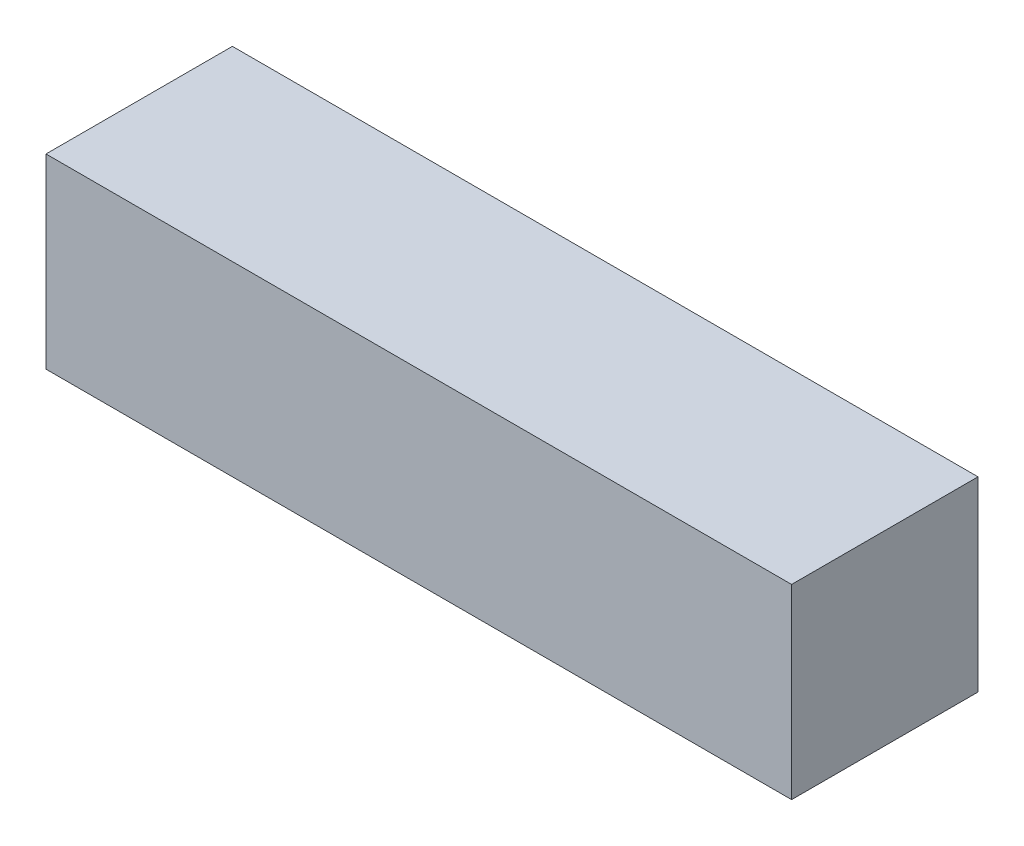
ISO-10303-21;
HEADER;
FILE_DESCRIPTION(('STEP AP214'),'2;1');
FILE_NAME('part.step','',(''),(''),'','','');
FILE_SCHEMA(('AUTOMOTIVE_DESIGN { 1 0 10303 214 1 1 1 1 }'));
ENDSEC;
DATA;
#1=APPLICATION_CONTEXT('core data for automotive mechanical design processes');
#2=APPLICATION_PROTOCOL_DEFINITION('international standard','automotive_design',2000,#1);
#3=PRODUCT_CONTEXT('',#1,'mechanical');
#4=PRODUCT('Part','Part','',(#3));
#5=PRODUCT_RELATED_PRODUCT_CATEGORY('part','',(#4));
#6=PRODUCT_DEFINITION_FORMATION('','',#4);
#7=PRODUCT_DEFINITION_CONTEXT('part definition',#1,'design');
#8=PRODUCT_DEFINITION('design','',#6,#7);
#9=PRODUCT_DEFINITION_SHAPE('','',#8);
#10=(LENGTH_UNIT() NAMED_UNIT(*) SI_UNIT(.MILLI.,.METRE.));
#11=(NAMED_UNIT(*) PLANE_ANGLE_UNIT() SI_UNIT($,.RADIAN.));
#12=(NAMED_UNIT(*) SI_UNIT($,.STERADIAN.) SOLID_ANGLE_UNIT());
#13=UNCERTAINTY_MEASURE_WITH_UNIT(LENGTH_MEASURE(1.E-05),#10,'distance_accuracy_value','');
#14=(GEOMETRIC_REPRESENTATION_CONTEXT(3) GLOBAL_UNCERTAINTY_ASSIGNED_CONTEXT((#13)) GLOBAL_UNIT_ASSIGNED_CONTEXT((#10,
#11,#12)) REPRESENTATION_CONTEXT('',''));
#15=CARTESIAN_POINT('',(0.,0.,0.));
#16=DIRECTION('',(0.,0.,1.));
#17=DIRECTION('',(1.,0.,0.));
#18=AXIS2_PLACEMENT_3D('',#15,#16,#17);
#19=CARTESIAN_POINT('',(12.,6.,-3.));
#20=DIRECTION('',(-1.,0.,0.));
#21=DIRECTION('',(0.,0.,1.));
#22=AXIS2_PLACEMENT_3D('',#19,#20,#21);
#23=PLANE('',#22);
#24=DIRECTION('',(0.,0.,-1.));
#25=VECTOR('',#24,1.);
#26=CARTESIAN_POINT('',(12.,0.,-3.));
#27=LINE('',#26,#25);
#28=CARTESIAN_POINT('',(12.,0.,3.));
#29=VERTEX_POINT('',#28);
#30=CARTESIAN_POINT('',(12.,0.,-3.));
#31=VERTEX_POINT('',#30);
#32=EDGE_CURVE('E98',#29,#31,#27,.T.);
#33=ORIENTED_EDGE('',*,*,#32,.T.);
#34=DIRECTION('',(0.,-1.,0.));
#35=VECTOR('',#34,1.);
#36=CARTESIAN_POINT('',(12.,6.,-3.));
#37=LINE('',#36,#35);
#38=CARTESIAN_POINT('',(12.,6.,-3.));
#39=VERTEX_POINT('',#38);
#40=EDGE_CURVE('E11',#39,#31,#37,.T.);
#41=ORIENTED_EDGE('',*,*,#40,.F.);
#42=DIRECTION('',(0.,0.,-1.));
#43=VECTOR('',#42,1.);
#44=CARTESIAN_POINT('',(12.,6.,-3.));
#45=LINE('',#44,#43);
#46=CARTESIAN_POINT('',(12.,6.,3.));
#47=VERTEX_POINT('',#46);
#48=EDGE_CURVE('E86',#47,#39,#45,.T.);
#49=ORIENTED_EDGE('',*,*,#48,.F.);
#50=DIRECTION('',(0.,-1.,0.));
#51=VECTOR('',#50,1.);
#52=CARTESIAN_POINT('',(12.,6.,3.));
#53=LINE('',#52,#51);
#54=EDGE_CURVE('E94',#47,#29,#53,.T.);
#55=ORIENTED_EDGE('',*,*,#54,.T.);
#56=EDGE_LOOP('',(#33,#41,#49,#55));
#57=FACE_BOUND('',#56,.T.);
#58=ADVANCED_FACE('F35',(#57),#23,.F.);
#59=CARTESIAN_POINT('',(-12.,6.,-3.));
#60=DIRECTION('',(0.,0.,1.));
#61=DIRECTION('',(1.,0.,0.));
#62=AXIS2_PLACEMENT_3D('',#59,#60,#61);
#63=PLANE('',#62);
#64=DIRECTION('',(-1.,0.,0.));
#65=VECTOR('',#64,1.);
#66=CARTESIAN_POINT('',(-12.,0.,-3.));
#67=LINE('',#66,#65);
#68=CARTESIAN_POINT('',(-12.,0.,-3.));
#69=VERTEX_POINT('',#68);
#70=EDGE_CURVE('E90',#31,#69,#67,.T.);
#71=ORIENTED_EDGE('',*,*,#70,.T.);
#72=DIRECTION('',(0.,-1.,0.));
#73=VECTOR('',#72,1.);
#74=CARTESIAN_POINT('',(-12.,6.,-3.));
#75=LINE('',#74,#73);
#76=CARTESIAN_POINT('',(-12.,6.,-3.));
#77=VERTEX_POINT('',#76);
#78=EDGE_CURVE('E43',#77,#69,#75,.T.);
#79=ORIENTED_EDGE('',*,*,#78,.F.);
#80=DIRECTION('',(-1.,0.,0.));
#81=VECTOR('',#80,1.);
#82=CARTESIAN_POINT('',(-12.,6.,-3.));
#83=LINE('',#82,#81);
#84=EDGE_CURVE('E81',#39,#77,#83,.T.);
#85=ORIENTED_EDGE('',*,*,#84,.F.);
#86=ORIENTED_EDGE('',*,*,#40,.T.);
#87=EDGE_LOOP('',(#71,#79,#85,#86));
#88=FACE_BOUND('',#87,.T.);
#89=ADVANCED_FACE('F89',(#88),#63,.F.);
#90=CARTESIAN_POINT('',(-12.,6.,-3.));
#91=DIRECTION('',(1.,0.,0.));
#92=DIRECTION('',(0.,0.,-1.));
#93=AXIS2_PLACEMENT_3D('',#90,#91,#92);
#94=PLANE('',#93);
#95=DIRECTION('',(0.,0.,1.));
#96=VECTOR('',#95,1.);
#97=CARTESIAN_POINT('',(-12.,0.,-3.));
#98=LINE('',#97,#96);
#99=CARTESIAN_POINT('',(-12.,0.,3.));
#100=VERTEX_POINT('',#99);
#101=EDGE_CURVE('E68',#69,#100,#98,.T.);
#102=ORIENTED_EDGE('',*,*,#101,.T.);
#103=DIRECTION('',(0.,-1.,0.));
#104=VECTOR('',#103,1.);
#105=CARTESIAN_POINT('',(-12.,6.,3.));
#106=LINE('',#105,#104);
#107=CARTESIAN_POINT('',(-12.,6.,3.));
#108=VERTEX_POINT('',#107);
#109=EDGE_CURVE('E91',#108,#100,#106,.T.);
#110=ORIENTED_EDGE('',*,*,#109,.F.);
#111=DIRECTION('',(0.,0.,1.));
#112=VECTOR('',#111,1.);
#113=CARTESIAN_POINT('',(-12.,6.,-3.));
#114=LINE('',#113,#112);
#115=EDGE_CURVE('E84',#77,#108,#114,.T.);
#116=ORIENTED_EDGE('',*,*,#115,.F.);
#117=ORIENTED_EDGE('',*,*,#78,.T.);
#118=EDGE_LOOP('',(#102,#110,#116,#117));
#119=FACE_BOUND('',#118,.T.);
#120=ADVANCED_FACE('F92',(#119),#94,.F.);
#121=CARTESIAN_POINT('',(-12.,6.,3.));
#122=DIRECTION('',(0.,0.,-1.));
#123=DIRECTION('',(-1.,0.,0.));
#124=AXIS2_PLACEMENT_3D('',#121,#122,#123);
#125=PLANE('',#124);
#126=DIRECTION('',(1.,0.,0.));
#127=VECTOR('',#126,1.);
#128=CARTESIAN_POINT('',(-12.,0.,3.));
#129=LINE('',#128,#127);
#130=EDGE_CURVE('E74',#100,#29,#129,.T.);
#131=ORIENTED_EDGE('',*,*,#130,.T.);
#132=ORIENTED_EDGE('',*,*,#54,.F.);
#133=DIRECTION('',(1.,0.,0.));
#134=VECTOR('',#133,1.);
#135=CARTESIAN_POINT('',(-12.,6.,3.));
#136=LINE('',#135,#134);
#137=EDGE_CURVE('E51',#108,#47,#136,.T.);
#138=ORIENTED_EDGE('',*,*,#137,.F.);
#139=ORIENTED_EDGE('',*,*,#109,.T.);
#140=EDGE_LOOP('',(#131,#132,#138,#139));
#141=FACE_BOUND('',#140,.T.);
#142=ADVANCED_FACE('F105',(#141),#125,.F.);
#143=CARTESIAN_POINT('',(0.,6.,0.));
#144=DIRECTION('',(0.,1.,0.));
#145=DIRECTION('',(0.,0.,1.));
#146=AXIS2_PLACEMENT_3D('',#143,#144,#145);
#147=PLANE('',#146);
#148=ORIENTED_EDGE('',*,*,#48,.T.);
#149=ORIENTED_EDGE('',*,*,#84,.T.);
#150=ORIENTED_EDGE('',*,*,#115,.T.);
#151=ORIENTED_EDGE('',*,*,#137,.T.);
#152=EDGE_LOOP('',(#148,#149,#150,#151));
#153=FACE_BOUND('',#152,.T.);
#154=ADVANCED_FACE('F82',(#153),#147,.T.);
#155=CARTESIAN_POINT('',(0.,0.,0.));
#156=DIRECTION('',(0.,1.,0.));
#157=DIRECTION('',(0.,0.,1.));
#158=AXIS2_PLACEMENT_3D('',#155,#156,#157);
#159=PLANE('',#158);
#160=ORIENTED_EDGE('',*,*,#32,.F.);
#161=ORIENTED_EDGE('',*,*,#130,.F.);
#162=ORIENTED_EDGE('',*,*,#101,.F.);
#163=ORIENTED_EDGE('',*,*,#70,.F.);
#164=EDGE_LOOP('',(#160,#161,#162,#163));
#165=FACE_BOUND('',#164,.T.);
#166=ADVANCED_FACE('F108',(#165),#159,.F.);
#167=CLOSED_SHELL('',(#58,#89,#120,#142,#154,#166));
#168=MANIFOLD_SOLID_BREP('B2',#167);
#169=ADVANCED_BREP_SHAPE_REPRESENTATION('',(#18,#168),#14);
#170=SHAPE_DEFINITION_REPRESENTATION(#9,#169);
ENDSEC;
END-ISO-10303-21;
